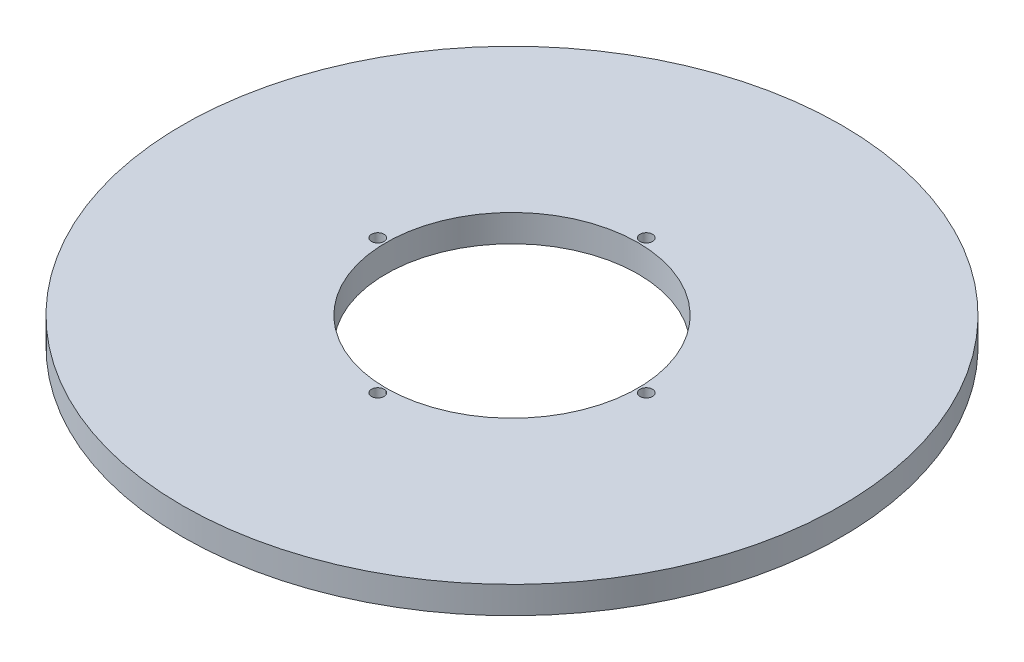
ISO-10303-21;
HEADER;
FILE_DESCRIPTION(('STEP AP214'),'2;1');
FILE_NAME('part.step','',(''),(''),'','','');
FILE_SCHEMA(('AUTOMOTIVE_DESIGN { 1 0 10303 214 1 1 1 1 }'));
ENDSEC;
DATA;
#1=APPLICATION_CONTEXT('core data for automotive mechanical design processes');
#2=APPLICATION_PROTOCOL_DEFINITION('international standard','automotive_design',2000,#1);
#3=PRODUCT_CONTEXT('',#1,'mechanical');
#4=PRODUCT('Part','Part','',(#3));
#5=PRODUCT_RELATED_PRODUCT_CATEGORY('part','',(#4));
#6=PRODUCT_DEFINITION_FORMATION('','',#4);
#7=PRODUCT_DEFINITION_CONTEXT('part definition',#1,'design');
#8=PRODUCT_DEFINITION('design','',#6,#7);
#9=PRODUCT_DEFINITION_SHAPE('','',#8);
#10=(LENGTH_UNIT() NAMED_UNIT(*) SI_UNIT(.MILLI.,.METRE.));
#11=(NAMED_UNIT(*) PLANE_ANGLE_UNIT() SI_UNIT($,.RADIAN.));
#12=(NAMED_UNIT(*) SI_UNIT($,.STERADIAN.) SOLID_ANGLE_UNIT());
#13=UNCERTAINTY_MEASURE_WITH_UNIT(LENGTH_MEASURE(1.E-05),#10,'distance_accuracy_value','');
#14=(GEOMETRIC_REPRESENTATION_CONTEXT(3) GLOBAL_UNCERTAINTY_ASSIGNED_CONTEXT((#13)) GLOBAL_UNIT_ASSIGNED_CONTEXT((#10,
#11,#12)) REPRESENTATION_CONTEXT('',''));
#15=CARTESIAN_POINT('',(0.,0.,0.));
#16=DIRECTION('',(0.,0.,1.));
#17=DIRECTION('',(1.,0.,0.));
#18=AXIS2_PLACEMENT_3D('',#15,#16,#17);
#19=CARTESIAN_POINT('',(0.,7.,0.));
#20=DIRECTION('',(0.,-1.,0.));
#21=DIRECTION('',(0.,0.,-1.));
#22=AXIS2_PLACEMENT_3D('',#19,#20,#21);
#23=CYLINDRICAL_SURFACE('',#22,85.);
#24=CARTESIAN_POINT('',(0.,7.,0.));
#25=DIRECTION('',(0.,1.,0.));
#26=DIRECTION('',(0.,0.,1.));
#27=AXIS2_PLACEMENT_3D('',#24,#25,#26);
#28=CIRCLE('',#27,85.);
#29=CARTESIAN_POINT('',(0.,7.,85.));
#30=VERTEX_POINT('',#29);
#31=EDGE_CURVE('E10',#30,#30,#28,.T.);
#32=ORIENTED_EDGE('',*,*,#31,.F.);
#33=EDGE_LOOP('',(#32));
#34=FACE_BOUND('',#33,.T.);
#35=CARTESIAN_POINT('',(0.,0.,0.));
#36=DIRECTION('',(0.,1.,0.));
#37=DIRECTION('',(0.,0.,1.));
#38=AXIS2_PLACEMENT_3D('',#35,#36,#37);
#39=CIRCLE('',#38,85.);
#40=CARTESIAN_POINT('',(0.,0.,85.));
#41=VERTEX_POINT('',#40);
#42=EDGE_CURVE('E37',#41,#41,#39,.T.);
#43=ORIENTED_EDGE('',*,*,#42,.T.);
#44=EDGE_LOOP('',(#43));
#45=FACE_BOUND('',#44,.T.);
#46=ADVANCED_FACE('F40',(#34,#45),#23,.T.);
#47=CARTESIAN_POINT('',(0.,7.,0.));
#48=DIRECTION('',(0.,1.,0.));
#49=DIRECTION('',(0.,0.,1.));
#50=AXIS2_PLACEMENT_3D('',#47,#48,#49);
#51=PLANE('',#50);
#52=CARTESIAN_POINT('',(1.20874756698204E-13,7.,34.6199062711457));
#53=DIRECTION('',(0.,1.,0.));
#54=DIRECTION('',(1.,0.,0.));
#55=AXIS2_PLACEMENT_3D('',#52,#53,#54);
#56=CIRCLE('',#55,1.62570054285417);
#57=CARTESIAN_POINT('',(1.62570054285429,7.,34.6199062711457));
#58=VERTEX_POINT('',#57);
#59=EDGE_CURVE('E71',#58,#58,#56,.T.);
#60=ORIENTED_EDGE('',*,*,#59,.F.);
#61=EDGE_LOOP('',(#60));
#62=FACE_BOUND('',#61,.T.);
#63=CARTESIAN_POINT('',(34.6199062711457,7.,0.));
#64=DIRECTION('',(0.,1.,0.));
#65=DIRECTION('',(0.,0.,-1.));
#66=AXIS2_PLACEMENT_3D('',#63,#64,#65);
#67=CIRCLE('',#66,1.62570054285417);
#68=CARTESIAN_POINT('',(34.6199062711457,7.,-1.62570054285417));
#69=VERTEX_POINT('',#68);
#70=EDGE_CURVE('E70',#69,#69,#67,.T.);
#71=ORIENTED_EDGE('',*,*,#70,.F.);
#72=EDGE_LOOP('',(#71));
#73=FACE_BOUND('',#72,.T.);
#74=CARTESIAN_POINT('',(-3.62624270094611E-13,7.,-34.6199062711457));
#75=DIRECTION('',(0.,1.,0.));
#76=DIRECTION('',(-1.,0.,0.));
#77=AXIS2_PLACEMENT_3D('',#74,#75,#76);
#78=CIRCLE('',#77,1.62570054285417);
#79=CARTESIAN_POINT('',(-1.62570054285453,7.,-34.6199062711457));
#80=VERTEX_POINT('',#79);
#81=EDGE_CURVE('E61',#80,#80,#78,.T.);
#82=ORIENTED_EDGE('',*,*,#81,.F.);
#83=EDGE_LOOP('',(#82));
#84=FACE_BOUND('',#83,.T.);
#85=CARTESIAN_POINT('',(-34.6199062711457,7.,0.));
#86=DIRECTION('',(0.,1.,0.));
#87=DIRECTION('',(0.,0.,1.));
#88=AXIS2_PLACEMENT_3D('',#85,#86,#87);
#89=CIRCLE('',#88,1.62570054285417);
#90=CARTESIAN_POINT('',(-34.6199062711457,7.,1.62570054285417));
#91=VERTEX_POINT('',#90);
#92=EDGE_CURVE('E54',#91,#91,#89,.T.);
#93=ORIENTED_EDGE('',*,*,#92,.F.);
#94=EDGE_LOOP('',(#93));
#95=FACE_BOUND('',#94,.T.);
#96=CARTESIAN_POINT('',(0.,7.,0.));
#97=DIRECTION('',(0.,1.,0.));
#98=DIRECTION('',(0.,0.,1.));
#99=AXIS2_PLACEMENT_3D('',#96,#97,#98);
#100=CIRCLE('',#99,32.5);
#101=CARTESIAN_POINT('',(0.,7.,32.5));
#102=VERTEX_POINT('',#101);
#103=EDGE_CURVE('E50',#102,#102,#100,.T.);
#104=ORIENTED_EDGE('',*,*,#103,.F.);
#105=EDGE_LOOP('',(#104));
#106=FACE_BOUND('',#105,.T.);
#107=ORIENTED_EDGE('',*,*,#31,.T.);
#108=EDGE_LOOP('',(#107));
#109=FACE_BOUND('',#108,.T.);
#110=ADVANCED_FACE('F86',(#62,#73,#84,#95,#106,#109),#51,.T.);
#111=CARTESIAN_POINT('',(0.,0.,0.));
#112=DIRECTION('',(0.,1.,0.));
#113=DIRECTION('',(0.,0.,1.));
#114=AXIS2_PLACEMENT_3D('',#111,#112,#113);
#115=PLANE('',#114);
#116=CARTESIAN_POINT('',(0.,0.,0.));
#117=DIRECTION('',(0.,1.,0.));
#118=DIRECTION('',(0.,0.,1.));
#119=AXIS2_PLACEMENT_3D('',#116,#117,#118);
#120=CIRCLE('',#119,32.5);
#121=CARTESIAN_POINT('',(0.,0.,32.5));
#122=VERTEX_POINT('',#121);
#123=EDGE_CURVE('E47',#122,#122,#120,.T.);
#124=ORIENTED_EDGE('',*,*,#123,.T.);
#125=EDGE_LOOP('',(#124));
#126=FACE_BOUND('',#125,.T.);
#127=ORIENTED_EDGE('',*,*,#42,.F.);
#128=EDGE_LOOP('',(#127));
#129=FACE_BOUND('',#128,.T.);
#130=ADVANCED_FACE('F93',(#126,#129),#115,.F.);
#131=CARTESIAN_POINT('',(0.,7.,0.));
#132=DIRECTION('',(0.,-1.,0.));
#133=DIRECTION('',(0.,0.,-1.));
#134=AXIS2_PLACEMENT_3D('',#131,#132,#133);
#135=CYLINDRICAL_SURFACE('',#134,32.5);
#136=ORIENTED_EDGE('',*,*,#103,.T.);
#137=EDGE_LOOP('',(#136));
#138=FACE_BOUND('',#137,.T.);
#139=ORIENTED_EDGE('',*,*,#123,.F.);
#140=EDGE_LOOP('',(#139));
#141=FACE_BOUND('',#140,.T.);
#142=ADVANCED_FACE('F101',(#138,#141),#135,.F.);
#143=CARTESIAN_POINT('',(-34.6199062711457,0.127316845264392,0.));
#144=DIRECTION('',(0.,1.,0.));
#145=DIRECTION('',(0.,0.,1.));
#146=AXIS2_PLACEMENT_3D('',#143,#144,#145);
#147=CYLINDRICAL_SURFACE('',#146,1.62570054285417);
#148=CARTESIAN_POINT('',(-34.6199062711457,0.127316845264392,0.));
#149=DIRECTION('',(0.,1.,0.));
#150=DIRECTION('',(0.,0.,1.));
#151=AXIS2_PLACEMENT_3D('',#148,#149,#150);
#152=CIRCLE('',#151,1.62570054285417);
#153=CARTESIAN_POINT('',(-34.6199062711457,0.127316845264392,1.62570054285417));
#154=VERTEX_POINT('',#153);
#155=EDGE_CURVE('E55',#154,#154,#152,.T.);
#156=ORIENTED_EDGE('',*,*,#155,.F.);
#157=EDGE_LOOP('',(#156));
#158=FACE_BOUND('',#157,.T.);
#159=ORIENTED_EDGE('',*,*,#92,.T.);
#160=EDGE_LOOP('',(#159));
#161=FACE_BOUND('',#160,.T.);
#162=ADVANCED_FACE('F102',(#158,#161),#147,.F.);
#163=CARTESIAN_POINT('',(-34.6199062711457,0.127316845264392,0.));
#164=DIRECTION('',(0.,1.,0.));
#165=DIRECTION('',(0.,0.,1.));
#166=AXIS2_PLACEMENT_3D('',#163,#164,#165);
#167=PLANE('',#166);
#168=ORIENTED_EDGE('',*,*,#155,.T.);
#169=EDGE_LOOP('',(#168));
#170=FACE_BOUND('',#169,.T.);
#171=ADVANCED_FACE('F133',(#170),#167,.T.);
#172=CARTESIAN_POINT('',(-3.62624270094611E-13,0.127316845264392,-34.6199062711457));
#173=DIRECTION('',(0.,1.,0.));
#174=DIRECTION('',(0.,0.,1.));
#175=AXIS2_PLACEMENT_3D('',#172,#173,#174);
#176=CYLINDRICAL_SURFACE('',#175,1.62570054285417);
#177=CARTESIAN_POINT('',(-3.62624270094611E-13,0.127316845264392,-34.6199062711457));
#178=DIRECTION('',(0.,1.,0.));
#179=DIRECTION('',(-1.,0.,0.));
#180=AXIS2_PLACEMENT_3D('',#177,#178,#179);
#181=CIRCLE('',#180,1.62570054285417);
#182=CARTESIAN_POINT('',(-1.62570054285453,0.127316845264392,-34.6199062711457));
#183=VERTEX_POINT('',#182);
#184=EDGE_CURVE('E63',#183,#183,#181,.T.);
#185=ORIENTED_EDGE('',*,*,#184,.F.);
#186=EDGE_LOOP('',(#185));
#187=FACE_BOUND('',#186,.T.);
#188=ORIENTED_EDGE('',*,*,#81,.T.);
#189=EDGE_LOOP('',(#188));
#190=FACE_BOUND('',#189,.T.);
#191=ADVANCED_FACE('F142',(#187,#190),#176,.F.);
#192=CARTESIAN_POINT('',(-3.62624270094611E-13,0.127316845264392,-34.6199062711457));
#193=DIRECTION('',(0.,1.,0.));
#194=DIRECTION('',(-1.,0.,0.));
#195=AXIS2_PLACEMENT_3D('',#192,#193,#194);
#196=PLANE('',#195);
#197=ORIENTED_EDGE('',*,*,#184,.T.);
#198=EDGE_LOOP('',(#197));
#199=FACE_BOUND('',#198,.T.);
#200=ADVANCED_FACE('F156',(#199),#196,.T.);
#201=CARTESIAN_POINT('',(34.6199062711457,0.127316845264392,0.));
#202=DIRECTION('',(0.,1.,0.));
#203=DIRECTION('',(0.,0.,1.));
#204=AXIS2_PLACEMENT_3D('',#201,#202,#203);
#205=CYLINDRICAL_SURFACE('',#204,1.62570054285417);
#206=CARTESIAN_POINT('',(34.6199062711457,0.127316845264392,0.));
#207=DIRECTION('',(0.,1.,0.));
#208=DIRECTION('',(0.,0.,-1.));
#209=AXIS2_PLACEMENT_3D('',#206,#207,#208);
#210=CIRCLE('',#209,1.62570054285417);
#211=CARTESIAN_POINT('',(34.6199062711457,0.127316845264392,-1.62570054285417));
#212=VERTEX_POINT('',#211);
#213=EDGE_CURVE('E69',#212,#212,#210,.T.);
#214=ORIENTED_EDGE('',*,*,#213,.F.);
#215=EDGE_LOOP('',(#214));
#216=FACE_BOUND('',#215,.T.);
#217=ORIENTED_EDGE('',*,*,#70,.T.);
#218=EDGE_LOOP('',(#217));
#219=FACE_BOUND('',#218,.T.);
#220=ADVANCED_FACE('F164',(#216,#219),#205,.F.);
#221=CARTESIAN_POINT('',(34.6199062711457,0.127316845264392,0.));
#222=DIRECTION('',(0.,1.,0.));
#223=DIRECTION('',(0.,0.,-1.));
#224=AXIS2_PLACEMENT_3D('',#221,#222,#223);
#225=PLANE('',#224);
#226=ORIENTED_EDGE('',*,*,#213,.T.);
#227=EDGE_LOOP('',(#226));
#228=FACE_BOUND('',#227,.T.);
#229=ADVANCED_FACE('F83',(#228),#225,.T.);
#230=CARTESIAN_POINT('',(1.20874756698204E-13,0.127316845264392,34.6199062711457));
#231=DIRECTION('',(0.,1.,0.));
#232=DIRECTION('',(0.,0.,1.));
#233=AXIS2_PLACEMENT_3D('',#230,#231,#232);
#234=CYLINDRICAL_SURFACE('',#233,1.62570054285417);
#235=CARTESIAN_POINT('',(1.20874756698204E-13,0.127316845264392,34.6199062711457));
#236=DIRECTION('',(0.,1.,0.));
#237=DIRECTION('',(1.,0.,0.));
#238=AXIS2_PLACEMENT_3D('',#235,#236,#237);
#239=CIRCLE('',#238,1.62570054285417);
#240=CARTESIAN_POINT('',(1.62570054285429,0.127316845264392,34.6199062711457));
#241=VERTEX_POINT('',#240);
#242=EDGE_CURVE('E59',#241,#241,#239,.T.);
#243=ORIENTED_EDGE('',*,*,#242,.F.);
#244=EDGE_LOOP('',(#243));
#245=FACE_BOUND('',#244,.T.);
#246=ORIENTED_EDGE('',*,*,#59,.T.);
#247=EDGE_LOOP('',(#246));
#248=FACE_BOUND('',#247,.T.);
#249=ADVANCED_FACE('F81',(#245,#248),#234,.F.);
#250=CARTESIAN_POINT('',(1.20874756698204E-13,0.127316845264392,34.6199062711457));
#251=DIRECTION('',(0.,1.,0.));
#252=DIRECTION('',(1.,0.,0.));
#253=AXIS2_PLACEMENT_3D('',#250,#251,#252);
#254=PLANE('',#253);
#255=ORIENTED_EDGE('',*,*,#242,.T.);
#256=EDGE_LOOP('',(#255));
#257=FACE_BOUND('',#256,.T.);
#258=ADVANCED_FACE('F78',(#257),#254,.T.);
#259=CLOSED_SHELL('',(#46,#110,#130,#142,#162,#171,#191,#200,#220,#229,#249,#258));
#260=MANIFOLD_SOLID_BREP('B2',#259);
#261=ADVANCED_BREP_SHAPE_REPRESENTATION('',(#18,#260),#14);
#262=SHAPE_DEFINITION_REPRESENTATION(#9,#261);
ENDSEC;
END-ISO-10303-21;
